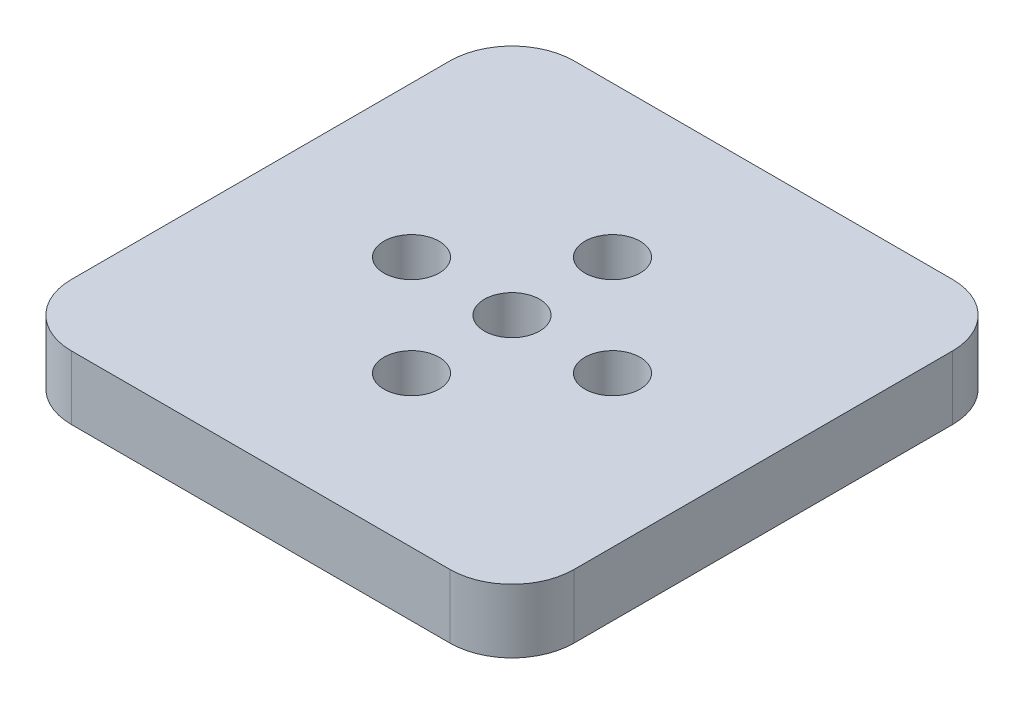
ISO-10303-21;
HEADER;
FILE_DESCRIPTION(('STEP AP214'),'2;1');
FILE_NAME('part.step','',(''),(''),'','','');
FILE_SCHEMA(('AUTOMOTIVE_DESIGN { 1 0 10303 214 1 1 1 1 }'));
ENDSEC;
DATA;
#1=APPLICATION_CONTEXT('core data for automotive mechanical design processes');
#2=APPLICATION_PROTOCOL_DEFINITION('international standard','automotive_design',2000,#1);
#3=PRODUCT_CONTEXT('',#1,'mechanical');
#4=PRODUCT('Part','Part','',(#3));
#5=PRODUCT_RELATED_PRODUCT_CATEGORY('part','',(#4));
#6=PRODUCT_DEFINITION_FORMATION('','',#4);
#7=PRODUCT_DEFINITION_CONTEXT('part definition',#1,'design');
#8=PRODUCT_DEFINITION('design','',#6,#7);
#9=PRODUCT_DEFINITION_SHAPE('','',#8);
#10=(LENGTH_UNIT() NAMED_UNIT(*) SI_UNIT(.MILLI.,.METRE.));
#11=(NAMED_UNIT(*) PLANE_ANGLE_UNIT() SI_UNIT($,.RADIAN.));
#12=(NAMED_UNIT(*) SI_UNIT($,.STERADIAN.) SOLID_ANGLE_UNIT());
#13=UNCERTAINTY_MEASURE_WITH_UNIT(LENGTH_MEASURE(1.E-05),#10,'distance_accuracy_value','');
#14=(GEOMETRIC_REPRESENTATION_CONTEXT(3) GLOBAL_UNCERTAINTY_ASSIGNED_CONTEXT((#13)) GLOBAL_UNIT_ASSIGNED_CONTEXT((#10,
#11,#12)) REPRESENTATION_CONTEXT('',''));
#15=CARTESIAN_POINT('',(0.,0.,0.));
#16=DIRECTION('',(0.,0.,1.));
#17=DIRECTION('',(1.,0.,0.));
#18=AXIS2_PLACEMENT_3D('',#15,#16,#17);
#19=CARTESIAN_POINT('',(18.83,-6.35,-18.83));
#20=DIRECTION('',(0.,-1.,0.));
#21=DIRECTION('',(0.,0.,-1.));
#22=AXIS2_PLACEMENT_3D('',#19,#20,#21);
#23=PLANE('',#22);
#24=CARTESIAN_POINT('',(0.,-6.35,-10.));
#25=DIRECTION('',(0.,1.,0.));
#26=DIRECTION('',(0.,0.,1.));
#27=AXIS2_PLACEMENT_3D('',#24,#25,#26);
#28=CIRCLE('',#27,2.75);
#29=CARTESIAN_POINT('',(0.,-6.35,-7.25));
#30=VERTEX_POINT('',#29);
#31=EDGE_CURVE('E326',#30,#30,#28,.T.);
#32=ORIENTED_EDGE('',*,*,#31,.T.);
#33=EDGE_LOOP('',(#32));
#34=FACE_BOUND('',#33,.T.);
#35=CARTESIAN_POINT('',(10.,-6.35,0.));
#36=DIRECTION('',(0.,1.,0.));
#37=DIRECTION('',(0.,0.,1.));
#38=AXIS2_PLACEMENT_3D('',#35,#36,#37);
#39=CIRCLE('',#38,2.75);
#40=CARTESIAN_POINT('',(10.,-6.35,2.75000000000003));
#41=VERTEX_POINT('',#40);
#42=EDGE_CURVE('E331',#41,#41,#39,.T.);
#43=ORIENTED_EDGE('',*,*,#42,.T.);
#44=EDGE_LOOP('',(#43));
#45=FACE_BOUND('',#44,.T.);
#46=CARTESIAN_POINT('',(18.83,-6.35,-18.83));
#47=DIRECTION('',(0.,1.,0.));
#48=DIRECTION('',(0.,0.,-1.));
#49=AXIS2_PLACEMENT_3D('',#46,#47,#48);
#50=CIRCLE('',#49,6.17);
#51=CARTESIAN_POINT('',(25.,-6.35,-18.83));
#52=VERTEX_POINT('',#51);
#53=CARTESIAN_POINT('',(18.83,-6.35,-25.));
#54=VERTEX_POINT('',#53);
#55=EDGE_CURVE('E155',#52,#54,#50,.T.);
#56=ORIENTED_EDGE('',*,*,#55,.F.);
#57=DIRECTION('',(0.,0.,-1.));
#58=VECTOR('',#57,1.);
#59=CARTESIAN_POINT('',(25.,-6.35,-18.83));
#60=LINE('',#59,#58);
#61=CARTESIAN_POINT('',(25.,-6.35,18.83));
#62=VERTEX_POINT('',#61);
#63=EDGE_CURVE('E124',#62,#52,#60,.T.);
#64=ORIENTED_EDGE('',*,*,#63,.F.);
#65=CARTESIAN_POINT('',(18.83,-6.35,18.83));
#66=DIRECTION('',(0.,1.,0.));
#67=DIRECTION('',(0.,0.,-1.));
#68=AXIS2_PLACEMENT_3D('',#65,#66,#67);
#69=CIRCLE('',#68,6.17);
#70=CARTESIAN_POINT('',(18.83,-6.35,25.));
#71=VERTEX_POINT('',#70);
#72=EDGE_CURVE('E109',#71,#62,#69,.T.);
#73=ORIENTED_EDGE('',*,*,#72,.F.);
#74=DIRECTION('',(1.,0.,0.));
#75=VECTOR('',#74,1.);
#76=CARTESIAN_POINT('',(-18.83,-6.35,25.));
#77=LINE('',#76,#75);
#78=CARTESIAN_POINT('',(-18.83,-6.35,25.));
#79=VERTEX_POINT('',#78);
#80=EDGE_CURVE('E122',#79,#71,#77,.T.);
#81=ORIENTED_EDGE('',*,*,#80,.F.);
#82=CARTESIAN_POINT('',(-18.83,-6.35,18.83));
#83=DIRECTION('',(0.,1.,0.));
#84=DIRECTION('',(0.,0.,-1.));
#85=AXIS2_PLACEMENT_3D('',#82,#83,#84);
#86=CIRCLE('',#85,6.17);
#87=CARTESIAN_POINT('',(-25.,-6.35,18.83));
#88=VERTEX_POINT('',#87);
#89=EDGE_CURVE('E127',#88,#79,#86,.T.);
#90=ORIENTED_EDGE('',*,*,#89,.F.);
#91=DIRECTION('',(0.,0.,1.));
#92=VECTOR('',#91,1.);
#93=CARTESIAN_POINT('',(-25.,-6.35,-18.83));
#94=LINE('',#93,#92);
#95=CARTESIAN_POINT('',(-25.,-6.35,-18.83));
#96=VERTEX_POINT('',#95);
#97=EDGE_CURVE('E129',#96,#88,#94,.T.);
#98=ORIENTED_EDGE('',*,*,#97,.F.);
#99=CARTESIAN_POINT('',(-18.83,-6.35,-18.83));
#100=DIRECTION('',(0.,1.,0.));
#101=DIRECTION('',(0.,0.,-1.));
#102=AXIS2_PLACEMENT_3D('',#99,#100,#101);
#103=CIRCLE('',#102,6.17);
#104=CARTESIAN_POINT('',(-18.83,-6.35,-25.));
#105=VERTEX_POINT('',#104);
#106=EDGE_CURVE('E226',#105,#96,#103,.T.);
#107=ORIENTED_EDGE('',*,*,#106,.F.);
#108=DIRECTION('',(-1.,0.,0.));
#109=VECTOR('',#108,1.);
#110=CARTESIAN_POINT('',(-18.83,-6.35,-25.));
#111=LINE('',#110,#109);
#112=EDGE_CURVE('E224',#54,#105,#111,.T.);
#113=ORIENTED_EDGE('',*,*,#112,.F.);
#114=EDGE_LOOP('',(#56,#64,#73,#81,#90,#98,#107,#113));
#115=FACE_BOUND('',#114,.T.);
#116=CARTESIAN_POINT('',(0.,-6.35,0.));
#117=DIRECTION('',(0.,1.,0.));
#118=DIRECTION('',(0.,0.,1.));
#119=AXIS2_PLACEMENT_3D('',#116,#117,#118);
#120=CIRCLE('',#119,2.75);
#121=CARTESIAN_POINT('',(0.,-6.35,2.75));
#122=VERTEX_POINT('',#121);
#123=EDGE_CURVE('E138',#122,#122,#120,.T.);
#124=ORIENTED_EDGE('',*,*,#123,.T.);
#125=EDGE_LOOP('',(#124));
#126=FACE_BOUND('',#125,.T.);
#127=CARTESIAN_POINT('',(-10.,-6.35,-1.04744440165294E-13));
#128=DIRECTION('',(0.,1.,0.));
#129=DIRECTION('',(0.,0.,1.));
#130=AXIS2_PLACEMENT_3D('',#127,#128,#129);
#131=CIRCLE('',#130,2.75);
#132=CARTESIAN_POINT('',(-10.,-6.35,2.74999999999989));
#133=VERTEX_POINT('',#132);
#134=EDGE_CURVE('E215',#133,#133,#131,.T.);
#135=ORIENTED_EDGE('',*,*,#134,.T.);
#136=EDGE_LOOP('',(#135));
#137=FACE_BOUND('',#136,.T.);
#138=CARTESIAN_POINT('',(5.64760248210638E-13,-6.35,10.));
#139=DIRECTION('',(0.,1.,0.));
#140=DIRECTION('',(0.,0.,1.));
#141=AXIS2_PLACEMENT_3D('',#138,#139,#140);
#142=CIRCLE('',#141,2.75);
#143=CARTESIAN_POINT('',(5.64760248210638E-13,-6.35,12.75));
#144=VERTEX_POINT('',#143);
#145=EDGE_CURVE('E335',#144,#144,#142,.T.);
#146=ORIENTED_EDGE('',*,*,#145,.T.);
#147=EDGE_LOOP('',(#146));
#148=FACE_BOUND('',#147,.T.);
#149=ADVANCED_FACE('F36',(#34,#45,#115,#126,#137,#148),#23,.T.);
#150=CARTESIAN_POINT('',(18.83,-6.35,-18.83));
#151=DIRECTION('',(0.,1.,0.));
#152=DIRECTION('',(0.,0.,1.));
#153=AXIS2_PLACEMENT_3D('',#150,#151,#152);
#154=CYLINDRICAL_SURFACE('',#153,6.17);
#155=CARTESIAN_POINT('',(18.83,0.,-18.83));
#156=DIRECTION('',(0.,1.,0.));
#157=DIRECTION('',(0.,0.,-1.));
#158=AXIS2_PLACEMENT_3D('',#155,#156,#157);
#159=CIRCLE('',#158,6.17);
#160=CARTESIAN_POINT('',(25.,0.,-18.83));
#161=VERTEX_POINT('',#160);
#162=CARTESIAN_POINT('',(18.83,0.,-25.));
#163=VERTEX_POINT('',#162);
#164=EDGE_CURVE('E134',#161,#163,#159,.T.);
#165=ORIENTED_EDGE('',*,*,#164,.F.);
#166=DIRECTION('',(0.,1.,0.));
#167=VECTOR('',#166,1.);
#168=CARTESIAN_POINT('',(25.,-6.35,-18.83));
#169=LINE('',#168,#167);
#170=EDGE_CURVE('E11',#52,#161,#169,.T.);
#171=ORIENTED_EDGE('',*,*,#170,.F.);
#172=ORIENTED_EDGE('',*,*,#55,.T.);
#173=DIRECTION('',(0.,1.,0.));
#174=VECTOR('',#173,1.);
#175=CARTESIAN_POINT('',(18.83,-6.35,-25.));
#176=LINE('',#175,#174);
#177=EDGE_CURVE('E40',#54,#163,#176,.T.);
#178=ORIENTED_EDGE('',*,*,#177,.T.);
#179=EDGE_LOOP('',(#165,#171,#172,#178));
#180=FACE_BOUND('',#179,.T.);
#181=ADVANCED_FACE('F38',(#180),#154,.T.);
#182=CARTESIAN_POINT('',(25.,-6.35,-18.83));
#183=DIRECTION('',(1.,0.,0.));
#184=DIRECTION('',(0.,0.,-1.));
#185=AXIS2_PLACEMENT_3D('',#182,#183,#184);
#186=PLANE('',#185);
#187=DIRECTION('',(0.,0.,-1.));
#188=VECTOR('',#187,1.);
#189=CARTESIAN_POINT('',(25.,0.,-18.83));
#190=LINE('',#189,#188);
#191=CARTESIAN_POINT('',(25.,0.,18.83));
#192=VERTEX_POINT('',#191);
#193=EDGE_CURVE('E153',#192,#161,#190,.T.);
#194=ORIENTED_EDGE('',*,*,#193,.F.);
#195=DIRECTION('',(0.,1.,0.));
#196=VECTOR('',#195,1.);
#197=CARTESIAN_POINT('',(25.,-6.35,18.83));
#198=LINE('',#197,#196);
#199=EDGE_CURVE('E46',#62,#192,#198,.T.);
#200=ORIENTED_EDGE('',*,*,#199,.F.);
#201=ORIENTED_EDGE('',*,*,#63,.T.);
#202=ORIENTED_EDGE('',*,*,#170,.T.);
#203=EDGE_LOOP('',(#194,#200,#201,#202));
#204=FACE_BOUND('',#203,.T.);
#205=ADVANCED_FACE('F167',(#204),#186,.T.);
#206=CARTESIAN_POINT('',(18.83,-6.35,18.83));
#207=DIRECTION('',(0.,1.,0.));
#208=DIRECTION('',(0.,0.,1.));
#209=AXIS2_PLACEMENT_3D('',#206,#207,#208);
#210=CYLINDRICAL_SURFACE('',#209,6.17);
#211=CARTESIAN_POINT('',(18.83,0.,18.83));
#212=DIRECTION('',(0.,1.,0.));
#213=DIRECTION('',(0.,0.,-1.));
#214=AXIS2_PLACEMENT_3D('',#211,#212,#213);
#215=CIRCLE('',#214,6.17);
#216=CARTESIAN_POINT('',(18.83,0.,25.));
#217=VERTEX_POINT('',#216);
#218=EDGE_CURVE('E111',#217,#192,#215,.T.);
#219=ORIENTED_EDGE('',*,*,#218,.F.);
#220=DIRECTION('',(0.,1.,0.));
#221=VECTOR('',#220,1.);
#222=CARTESIAN_POINT('',(18.83,-6.35,25.));
#223=LINE('',#222,#221);
#224=EDGE_CURVE('E106',#71,#217,#223,.T.);
#225=ORIENTED_EDGE('',*,*,#224,.F.);
#226=ORIENTED_EDGE('',*,*,#72,.T.);
#227=ORIENTED_EDGE('',*,*,#199,.T.);
#228=EDGE_LOOP('',(#219,#225,#226,#227));
#229=FACE_BOUND('',#228,.T.);
#230=ADVANCED_FACE('F108',(#229),#210,.T.);
#231=CARTESIAN_POINT('',(-18.83,-6.35,25.));
#232=DIRECTION('',(0.,0.,1.));
#233=DIRECTION('',(1.,0.,0.));
#234=AXIS2_PLACEMENT_3D('',#231,#232,#233);
#235=PLANE('',#234);
#236=DIRECTION('',(1.,0.,0.));
#237=VECTOR('',#236,1.);
#238=CARTESIAN_POINT('',(-18.83,0.,25.));
#239=LINE('',#238,#237);
#240=CARTESIAN_POINT('',(-18.83,0.,25.));
#241=VERTEX_POINT('',#240);
#242=EDGE_CURVE('E150',#241,#217,#239,.T.);
#243=ORIENTED_EDGE('',*,*,#242,.F.);
#244=DIRECTION('',(0.,1.,0.));
#245=VECTOR('',#244,1.);
#246=CARTESIAN_POINT('',(-18.83,-6.35,25.));
#247=LINE('',#246,#245);
#248=EDGE_CURVE('E116',#79,#241,#247,.T.);
#249=ORIENTED_EDGE('',*,*,#248,.F.);
#250=ORIENTED_EDGE('',*,*,#80,.T.);
#251=ORIENTED_EDGE('',*,*,#224,.T.);
#252=EDGE_LOOP('',(#243,#249,#250,#251));
#253=FACE_BOUND('',#252,.T.);
#254=ADVANCED_FACE('F126',(#253),#235,.T.);
#255=CARTESIAN_POINT('',(-18.83,-6.35,18.83));
#256=DIRECTION('',(0.,1.,0.));
#257=DIRECTION('',(0.,0.,1.));
#258=AXIS2_PLACEMENT_3D('',#255,#256,#257);
#259=CYLINDRICAL_SURFACE('',#258,6.17);
#260=CARTESIAN_POINT('',(-18.83,0.,18.83));
#261=DIRECTION('',(0.,1.,0.));
#262=DIRECTION('',(0.,0.,-1.));
#263=AXIS2_PLACEMENT_3D('',#260,#261,#262);
#264=CIRCLE('',#263,6.17);
#265=CARTESIAN_POINT('',(-25.,0.,18.83));
#266=VERTEX_POINT('',#265);
#267=EDGE_CURVE('E147',#266,#241,#264,.T.);
#268=ORIENTED_EDGE('',*,*,#267,.F.);
#269=DIRECTION('',(0.,1.,0.));
#270=VECTOR('',#269,1.);
#271=CARTESIAN_POINT('',(-25.,-6.35,18.83));
#272=LINE('',#271,#270);
#273=EDGE_CURVE('E159',#88,#266,#272,.T.);
#274=ORIENTED_EDGE('',*,*,#273,.F.);
#275=ORIENTED_EDGE('',*,*,#89,.T.);
#276=ORIENTED_EDGE('',*,*,#248,.T.);
#277=EDGE_LOOP('',(#268,#274,#275,#276));
#278=FACE_BOUND('',#277,.T.);
#279=ADVANCED_FACE('F237',(#278),#259,.T.);
#280=CARTESIAN_POINT('',(-25.,-6.35,-18.83));
#281=DIRECTION('',(-1.,0.,0.));
#282=DIRECTION('',(0.,0.,1.));
#283=AXIS2_PLACEMENT_3D('',#280,#281,#282);
#284=PLANE('',#283);
#285=DIRECTION('',(0.,0.,1.));
#286=VECTOR('',#285,1.);
#287=CARTESIAN_POINT('',(-25.,0.,-18.83));
#288=LINE('',#287,#286);
#289=CARTESIAN_POINT('',(-25.,0.,-18.83));
#290=VERTEX_POINT('',#289);
#291=EDGE_CURVE('E144',#290,#266,#288,.T.);
#292=ORIENTED_EDGE('',*,*,#291,.F.);
#293=DIRECTION('',(0.,1.,0.));
#294=VECTOR('',#293,1.);
#295=CARTESIAN_POINT('',(-25.,-6.35,-18.83));
#296=LINE('',#295,#294);
#297=EDGE_CURVE('E161',#96,#290,#296,.T.);
#298=ORIENTED_EDGE('',*,*,#297,.F.);
#299=ORIENTED_EDGE('',*,*,#97,.T.);
#300=ORIENTED_EDGE('',*,*,#273,.T.);
#301=EDGE_LOOP('',(#292,#298,#299,#300));
#302=FACE_BOUND('',#301,.T.);
#303=ADVANCED_FACE('F232',(#302),#284,.T.);
#304=CARTESIAN_POINT('',(-18.83,-6.35,-18.83));
#305=DIRECTION('',(0.,1.,0.));
#306=DIRECTION('',(0.,0.,1.));
#307=AXIS2_PLACEMENT_3D('',#304,#305,#306);
#308=CYLINDRICAL_SURFACE('',#307,6.17);
#309=CARTESIAN_POINT('',(-18.83,0.,-18.83));
#310=DIRECTION('',(0.,1.,0.));
#311=DIRECTION('',(0.,0.,-1.));
#312=AXIS2_PLACEMENT_3D('',#309,#310,#311);
#313=CIRCLE('',#312,6.17);
#314=CARTESIAN_POINT('',(-18.83,0.,-25.));
#315=VERTEX_POINT('',#314);
#316=EDGE_CURVE('E141',#315,#290,#313,.T.);
#317=ORIENTED_EDGE('',*,*,#316,.F.);
#318=DIRECTION('',(0.,1.,0.));
#319=VECTOR('',#318,1.);
#320=CARTESIAN_POINT('',(-18.83,-6.35,-25.));
#321=LINE('',#320,#319);
#322=EDGE_CURVE('E162',#105,#315,#321,.T.);
#323=ORIENTED_EDGE('',*,*,#322,.F.);
#324=ORIENTED_EDGE('',*,*,#106,.T.);
#325=ORIENTED_EDGE('',*,*,#297,.T.);
#326=EDGE_LOOP('',(#317,#323,#324,#325));
#327=FACE_BOUND('',#326,.T.);
#328=ADVANCED_FACE('F194',(#327),#308,.T.);
#329=CARTESIAN_POINT('',(-18.83,-6.35,-25.));
#330=DIRECTION('',(0.,0.,-1.));
#331=DIRECTION('',(-1.,0.,0.));
#332=AXIS2_PLACEMENT_3D('',#329,#330,#331);
#333=PLANE('',#332);
#334=DIRECTION('',(-1.,0.,0.));
#335=VECTOR('',#334,1.);
#336=CARTESIAN_POINT('',(-18.83,0.,-25.));
#337=LINE('',#336,#335);
#338=EDGE_CURVE('E137',#163,#315,#337,.T.);
#339=ORIENTED_EDGE('',*,*,#338,.F.);
#340=ORIENTED_EDGE('',*,*,#177,.F.);
#341=ORIENTED_EDGE('',*,*,#112,.T.);
#342=ORIENTED_EDGE('',*,*,#322,.T.);
#343=EDGE_LOOP('',(#339,#340,#341,#342));
#344=FACE_BOUND('',#343,.T.);
#345=ADVANCED_FACE('F164',(#344),#333,.T.);
#346=CARTESIAN_POINT('',(18.83,0.,-18.83));
#347=DIRECTION('',(0.,-1.,0.));
#348=DIRECTION('',(0.,0.,-1.));
#349=AXIS2_PLACEMENT_3D('',#346,#347,#348);
#350=PLANE('',#349);
#351=CARTESIAN_POINT('',(0.,0.,-10.));
#352=DIRECTION('',(0.,1.,0.));
#353=DIRECTION('',(0.,0.,1.));
#354=AXIS2_PLACEMENT_3D('',#351,#352,#353);
#355=CIRCLE('',#354,2.75);
#356=CARTESIAN_POINT('',(0.,0.,-7.25));
#357=VERTEX_POINT('',#356);
#358=EDGE_CURVE('E198',#357,#357,#355,.T.);
#359=ORIENTED_EDGE('',*,*,#358,.F.);
#360=EDGE_LOOP('',(#359));
#361=FACE_BOUND('',#360,.T.);
#362=CARTESIAN_POINT('',(10.,0.,0.));
#363=DIRECTION('',(0.,1.,0.));
#364=DIRECTION('',(0.,0.,1.));
#365=AXIS2_PLACEMENT_3D('',#362,#363,#364);
#366=CIRCLE('',#365,2.75);
#367=CARTESIAN_POINT('',(10.,0.,2.75000000000003));
#368=VERTEX_POINT('',#367);
#369=EDGE_CURVE('E202',#368,#368,#366,.T.);
#370=ORIENTED_EDGE('',*,*,#369,.F.);
#371=EDGE_LOOP('',(#370));
#372=FACE_BOUND('',#371,.T.);
#373=CARTESIAN_POINT('',(5.64760248210638E-13,0.,10.));
#374=DIRECTION('',(0.,1.,0.));
#375=DIRECTION('',(0.,0.,1.));
#376=AXIS2_PLACEMENT_3D('',#373,#374,#375);
#377=CIRCLE('',#376,2.75);
#378=CARTESIAN_POINT('',(5.64760248210638E-13,0.,12.75));
#379=VERTEX_POINT('',#378);
#380=EDGE_CURVE('E206',#379,#379,#377,.T.);
#381=ORIENTED_EDGE('',*,*,#380,.F.);
#382=EDGE_LOOP('',(#381));
#383=FACE_BOUND('',#382,.T.);
#384=CARTESIAN_POINT('',(-10.,0.,-1.04744440165294E-13));
#385=DIRECTION('',(0.,1.,0.));
#386=DIRECTION('',(0.,0.,1.));
#387=AXIS2_PLACEMENT_3D('',#384,#385,#386);
#388=CIRCLE('',#387,2.75);
#389=CARTESIAN_POINT('',(-10.,0.,2.74999999999989));
#390=VERTEX_POINT('',#389);
#391=EDGE_CURVE('E210',#390,#390,#388,.T.);
#392=ORIENTED_EDGE('',*,*,#391,.F.);
#393=EDGE_LOOP('',(#392));
#394=FACE_BOUND('',#393,.T.);
#395=CARTESIAN_POINT('',(0.,0.,0.));
#396=DIRECTION('',(0.,1.,0.));
#397=DIRECTION('',(0.,0.,1.));
#398=AXIS2_PLACEMENT_3D('',#395,#396,#397);
#399=CIRCLE('',#398,2.75);
#400=CARTESIAN_POINT('',(0.,0.,2.75));
#401=VERTEX_POINT('',#400);
#402=EDGE_CURVE('E213',#401,#401,#399,.T.);
#403=ORIENTED_EDGE('',*,*,#402,.F.);
#404=EDGE_LOOP('',(#403));
#405=FACE_BOUND('',#404,.T.);
#406=ORIENTED_EDGE('',*,*,#164,.T.);
#407=ORIENTED_EDGE('',*,*,#338,.T.);
#408=ORIENTED_EDGE('',*,*,#316,.T.);
#409=ORIENTED_EDGE('',*,*,#291,.T.);
#410=ORIENTED_EDGE('',*,*,#267,.T.);
#411=ORIENTED_EDGE('',*,*,#242,.T.);
#412=ORIENTED_EDGE('',*,*,#218,.T.);
#413=ORIENTED_EDGE('',*,*,#193,.T.);
#414=EDGE_LOOP('',(#406,#407,#408,#409,#410,#411,#412,#413));
#415=FACE_BOUND('',#414,.T.);
#416=ADVANCED_FACE('F166',(#361,#372,#383,#394,#405,#415),#350,.F.);
#417=CARTESIAN_POINT('',(0.,0.,0.));
#418=DIRECTION('',(0.,1.,0.));
#419=DIRECTION('',(0.,0.,1.));
#420=AXIS2_PLACEMENT_3D('',#417,#418,#419);
#421=CYLINDRICAL_SURFACE('',#420,2.75);
#422=ORIENTED_EDGE('',*,*,#123,.F.);
#423=EDGE_LOOP('',(#422));
#424=FACE_BOUND('',#423,.T.);
#425=ORIENTED_EDGE('',*,*,#402,.T.);
#426=EDGE_LOOP('',(#425));
#427=FACE_BOUND('',#426,.T.);
#428=ADVANCED_FACE('F184',(#424,#427),#421,.F.);
#429=CARTESIAN_POINT('',(-10.,0.,-1.04744440165294E-13));
#430=DIRECTION('',(0.,1.,0.));
#431=DIRECTION('',(0.,0.,1.));
#432=AXIS2_PLACEMENT_3D('',#429,#430,#431);
#433=CYLINDRICAL_SURFACE('',#432,2.75);
#434=ORIENTED_EDGE('',*,*,#134,.F.);
#435=EDGE_LOOP('',(#434));
#436=FACE_BOUND('',#435,.T.);
#437=ORIENTED_EDGE('',*,*,#391,.T.);
#438=EDGE_LOOP('',(#437));
#439=FACE_BOUND('',#438,.T.);
#440=ADVANCED_FACE('F192',(#436,#439),#433,.F.);
#441=CARTESIAN_POINT('',(5.64760248210638E-13,0.,10.));
#442=DIRECTION('',(0.,1.,0.));
#443=DIRECTION('',(0.,0.,1.));
#444=AXIS2_PLACEMENT_3D('',#441,#442,#443);
#445=CYLINDRICAL_SURFACE('',#444,2.75);
#446=ORIENTED_EDGE('',*,*,#145,.F.);
#447=EDGE_LOOP('',(#446));
#448=FACE_BOUND('',#447,.T.);
#449=ORIENTED_EDGE('',*,*,#380,.T.);
#450=EDGE_LOOP('',(#449));
#451=FACE_BOUND('',#450,.T.);
#452=ADVANCED_FACE('F282',(#448,#451),#445,.F.);
#453=CARTESIAN_POINT('',(10.,0.,0.));
#454=DIRECTION('',(0.,1.,0.));
#455=DIRECTION('',(0.,0.,1.));
#456=AXIS2_PLACEMENT_3D('',#453,#454,#455);
#457=CYLINDRICAL_SURFACE('',#456,2.75);
#458=ORIENTED_EDGE('',*,*,#42,.F.);
#459=EDGE_LOOP('',(#458));
#460=FACE_BOUND('',#459,.T.);
#461=ORIENTED_EDGE('',*,*,#369,.T.);
#462=EDGE_LOOP('',(#461));
#463=FACE_BOUND('',#462,.T.);
#464=ADVANCED_FACE('F292',(#460,#463),#457,.F.);
#465=CARTESIAN_POINT('',(0.,0.,-10.));
#466=DIRECTION('',(0.,1.,0.));
#467=DIRECTION('',(0.,0.,1.));
#468=AXIS2_PLACEMENT_3D('',#465,#466,#467);
#469=CYLINDRICAL_SURFACE('',#468,2.75);
#470=ORIENTED_EDGE('',*,*,#31,.F.);
#471=EDGE_LOOP('',(#470));
#472=FACE_BOUND('',#471,.T.);
#473=ORIENTED_EDGE('',*,*,#358,.T.);
#474=EDGE_LOOP('',(#473));
#475=FACE_BOUND('',#474,.T.);
#476=ADVANCED_FACE('F303',(#472,#475),#469,.F.);
#477=CLOSED_SHELL('',(#149,#181,#205,#230,#254,#279,#303,#328,#345,#416,#428,#440,#452,#464,#476));
#478=MANIFOLD_SOLID_BREP('B2',#477);
#479=ADVANCED_BREP_SHAPE_REPRESENTATION('',(#18,#478),#14);
#480=SHAPE_DEFINITION_REPRESENTATION(#9,#479);
ENDSEC;
END-ISO-10303-21;
